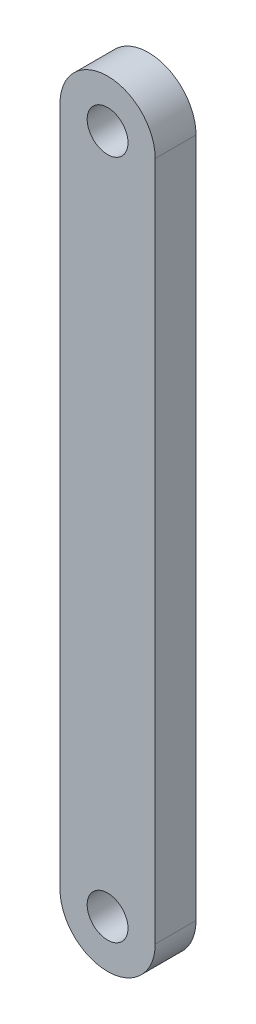
ISO-10303-21;
HEADER;
FILE_DESCRIPTION(('STEP AP214'),'2;1');
FILE_NAME('part.step','',(''),(''),'','','');
FILE_SCHEMA(('AUTOMOTIVE_DESIGN { 1 0 10303 214 1 1 1 1 }'));
ENDSEC;
DATA;
#1=APPLICATION_CONTEXT('core data for automotive mechanical design processes');
#2=APPLICATION_PROTOCOL_DEFINITION('international standard','automotive_design',2000,#1);
#3=PRODUCT_CONTEXT('',#1,'mechanical');
#4=PRODUCT('Part','Part','',(#3));
#5=PRODUCT_RELATED_PRODUCT_CATEGORY('part','',(#4));
#6=PRODUCT_DEFINITION_FORMATION('','',#4);
#7=PRODUCT_DEFINITION_CONTEXT('part definition',#1,'design');
#8=PRODUCT_DEFINITION('design','',#6,#7);
#9=PRODUCT_DEFINITION_SHAPE('','',#8);
#10=(LENGTH_UNIT() NAMED_UNIT(*) SI_UNIT(.MILLI.,.METRE.));
#11=(NAMED_UNIT(*) PLANE_ANGLE_UNIT() SI_UNIT($,.RADIAN.));
#12=(NAMED_UNIT(*) SI_UNIT($,.STERADIAN.) SOLID_ANGLE_UNIT());
#13=UNCERTAINTY_MEASURE_WITH_UNIT(LENGTH_MEASURE(1.E-05),#10,'distance_accuracy_value','');
#14=(GEOMETRIC_REPRESENTATION_CONTEXT(3) GLOBAL_UNCERTAINTY_ASSIGNED_CONTEXT((#13)) GLOBAL_UNIT_ASSIGNED_CONTEXT((#10,
#11,#12)) REPRESENTATION_CONTEXT('',''));
#15=CARTESIAN_POINT('',(0.,0.,0.));
#16=DIRECTION('',(0.,0.,1.));
#17=DIRECTION('',(1.,0.,0.));
#18=AXIS2_PLACEMENT_3D('',#15,#16,#17);
#19=CARTESIAN_POINT('',(0.,25.,1.5));
#20=DIRECTION('',(0.,0.,1.));
#21=DIRECTION('',(1.,0.,0.));
#22=AXIS2_PLACEMENT_3D('',#19,#20,#21);
#23=PLANE('',#22);
#24=CARTESIAN_POINT('',(0.,-25.,1.5));
#25=DIRECTION('',(0.,0.,1.));
#26=DIRECTION('',(1.,0.,0.));
#27=AXIS2_PLACEMENT_3D('',#24,#25,#26);
#28=CIRCLE('',#27,1.5);
#29=CARTESIAN_POINT('',(1.50000000000001,-25.,1.5));
#30=VERTEX_POINT('',#29);
#31=EDGE_CURVE('E103',#30,#30,#28,.T.);
#32=ORIENTED_EDGE('',*,*,#31,.F.);
#33=EDGE_LOOP('',(#32));
#34=FACE_BOUND('',#33,.T.);
#35=CARTESIAN_POINT('',(0.,25.,1.5));
#36=DIRECTION('',(0.,0.,1.));
#37=DIRECTION('',(1.,0.,0.));
#38=AXIS2_PLACEMENT_3D('',#35,#36,#37);
#39=CIRCLE('',#38,3.5);
#40=CARTESIAN_POINT('',(3.49999999999999,25.,1.5));
#41=VERTEX_POINT('',#40);
#42=CARTESIAN_POINT('',(-3.50000000000001,25.,1.5));
#43=VERTEX_POINT('',#42);
#44=EDGE_CURVE('E88',#41,#43,#39,.T.);
#45=ORIENTED_EDGE('',*,*,#44,.T.);
#46=DIRECTION('',(0.,-1.,0.));
#47=VECTOR('',#46,1.);
#48=CARTESIAN_POINT('',(-3.50000000000001,25.,1.5));
#49=LINE('',#48,#47);
#50=CARTESIAN_POINT('',(-3.49999999999999,-25.,1.5));
#51=VERTEX_POINT('',#50);
#52=EDGE_CURVE('E83',#43,#51,#49,.T.);
#53=ORIENTED_EDGE('',*,*,#52,.T.);
#54=CARTESIAN_POINT('',(0.,-25.,1.5));
#55=DIRECTION('',(0.,0.,1.));
#56=DIRECTION('',(1.,0.,0.));
#57=AXIS2_PLACEMENT_3D('',#54,#55,#56);
#58=CIRCLE('',#57,3.5);
#59=CARTESIAN_POINT('',(3.50000000000001,-25.,1.5));
#60=VERTEX_POINT('',#59);
#61=EDGE_CURVE('E86',#51,#60,#58,.T.);
#62=ORIENTED_EDGE('',*,*,#61,.T.);
#63=DIRECTION('',(0.,1.,0.));
#64=VECTOR('',#63,1.);
#65=CARTESIAN_POINT('',(3.49999999999999,25.,1.5));
#66=LINE('',#65,#64);
#67=EDGE_CURVE('E53',#60,#41,#66,.T.);
#68=ORIENTED_EDGE('',*,*,#67,.T.);
#69=EDGE_LOOP('',(#45,#53,#62,#68));
#70=FACE_BOUND('',#69,.T.);
#71=CARTESIAN_POINT('',(0.,25.,1.5));
#72=DIRECTION('',(0.,0.,1.));
#73=DIRECTION('',(1.,0.,0.));
#74=AXIS2_PLACEMENT_3D('',#71,#72,#73);
#75=CIRCLE('',#74,1.5);
#76=CARTESIAN_POINT('',(1.49999999999999,25.,1.5));
#77=VERTEX_POINT('',#76);
#78=EDGE_CURVE('E118',#77,#77,#75,.T.);
#79=ORIENTED_EDGE('',*,*,#78,.F.);
#80=EDGE_LOOP('',(#79));
#81=FACE_BOUND('',#80,.T.);
#82=ADVANCED_FACE('F36',(#34,#70,#81),#23,.T.);
#83=CARTESIAN_POINT('',(0.,25.,-1.5));
#84=DIRECTION('',(0.,0.,1.));
#85=DIRECTION('',(1.,0.,0.));
#86=AXIS2_PLACEMENT_3D('',#83,#84,#85);
#87=PLANE('',#86);
#88=CARTESIAN_POINT('',(0.,25.,-1.5));
#89=DIRECTION('',(0.,0.,1.));
#90=DIRECTION('',(1.,0.,0.));
#91=AXIS2_PLACEMENT_3D('',#88,#89,#90);
#92=CIRCLE('',#91,3.5);
#93=CARTESIAN_POINT('',(3.49999999999999,25.,-1.5));
#94=VERTEX_POINT('',#93);
#95=CARTESIAN_POINT('',(-3.50000000000001,25.,-1.5));
#96=VERTEX_POINT('',#95);
#97=EDGE_CURVE('E100',#94,#96,#92,.T.);
#98=ORIENTED_EDGE('',*,*,#97,.F.);
#99=DIRECTION('',(0.,1.,0.));
#100=VECTOR('',#99,1.);
#101=CARTESIAN_POINT('',(3.49999999999999,25.,-1.5));
#102=LINE('',#101,#100);
#103=CARTESIAN_POINT('',(3.50000000000001,-25.,-1.5));
#104=VERTEX_POINT('',#103);
#105=EDGE_CURVE('E76',#104,#94,#102,.T.);
#106=ORIENTED_EDGE('',*,*,#105,.F.);
#107=CARTESIAN_POINT('',(0.,-25.,-1.5));
#108=DIRECTION('',(0.,0.,1.));
#109=DIRECTION('',(1.,0.,0.));
#110=AXIS2_PLACEMENT_3D('',#107,#108,#109);
#111=CIRCLE('',#110,3.5);
#112=CARTESIAN_POINT('',(-3.49999999999999,-25.,-1.5));
#113=VERTEX_POINT('',#112);
#114=EDGE_CURVE('E70',#113,#104,#111,.T.);
#115=ORIENTED_EDGE('',*,*,#114,.F.);
#116=DIRECTION('',(0.,-1.,0.));
#117=VECTOR('',#116,1.);
#118=CARTESIAN_POINT('',(-3.50000000000001,25.,-1.5));
#119=LINE('',#118,#117);
#120=EDGE_CURVE('E92',#96,#113,#119,.T.);
#121=ORIENTED_EDGE('',*,*,#120,.F.);
#122=EDGE_LOOP('',(#98,#106,#115,#121));
#123=FACE_BOUND('',#122,.T.);
#124=CARTESIAN_POINT('',(0.,-25.,-1.5));
#125=DIRECTION('',(0.,0.,1.));
#126=DIRECTION('',(1.,0.,0.));
#127=AXIS2_PLACEMENT_3D('',#124,#125,#126);
#128=CIRCLE('',#127,1.5);
#129=CARTESIAN_POINT('',(1.50000000000001,-25.,-1.5));
#130=VERTEX_POINT('',#129);
#131=EDGE_CURVE('E115',#130,#130,#128,.T.);
#132=ORIENTED_EDGE('',*,*,#131,.T.);
#133=EDGE_LOOP('',(#132));
#134=FACE_BOUND('',#133,.T.);
#135=CARTESIAN_POINT('',(0.,25.,-1.5));
#136=DIRECTION('',(0.,0.,1.));
#137=DIRECTION('',(1.,0.,0.));
#138=AXIS2_PLACEMENT_3D('',#135,#136,#137);
#139=CIRCLE('',#138,1.5);
#140=CARTESIAN_POINT('',(1.49999999999999,25.,-1.5));
#141=VERTEX_POINT('',#140);
#142=EDGE_CURVE('E121',#141,#141,#139,.T.);
#143=ORIENTED_EDGE('',*,*,#142,.T.);
#144=EDGE_LOOP('',(#143));
#145=FACE_BOUND('',#144,.T.);
#146=ADVANCED_FACE('F111',(#123,#134,#145),#87,.F.);
#147=CARTESIAN_POINT('',(0.,25.,1.5));
#148=DIRECTION('',(0.,0.,-1.));
#149=DIRECTION('',(-1.,0.,0.));
#150=AXIS2_PLACEMENT_3D('',#147,#148,#149);
#151=CYLINDRICAL_SURFACE('',#150,3.5);
#152=ORIENTED_EDGE('',*,*,#97,.T.);
#153=DIRECTION('',(0.,0.,-1.));
#154=VECTOR('',#153,1.);
#155=CARTESIAN_POINT('',(-3.50000000000001,25.,1.5));
#156=LINE('',#155,#154);
#157=EDGE_CURVE('E11',#43,#96,#156,.T.);
#158=ORIENTED_EDGE('',*,*,#157,.F.);
#159=ORIENTED_EDGE('',*,*,#44,.F.);
#160=DIRECTION('',(0.,0.,-1.));
#161=VECTOR('',#160,1.);
#162=CARTESIAN_POINT('',(3.49999999999999,25.,1.5));
#163=LINE('',#162,#161);
#164=EDGE_CURVE('E96',#41,#94,#163,.T.);
#165=ORIENTED_EDGE('',*,*,#164,.T.);
#166=EDGE_LOOP('',(#152,#158,#159,#165));
#167=FACE_BOUND('',#166,.T.);
#168=ADVANCED_FACE('F38',(#167),#151,.T.);
#169=CARTESIAN_POINT('',(-3.50000000000001,25.,1.5));
#170=DIRECTION('',(1.,0.,0.));
#171=DIRECTION('',(0.,1.,0.));
#172=AXIS2_PLACEMENT_3D('',#169,#170,#171);
#173=PLANE('',#172);
#174=ORIENTED_EDGE('',*,*,#120,.T.);
#175=DIRECTION('',(0.,0.,-1.));
#176=VECTOR('',#175,1.);
#177=CARTESIAN_POINT('',(-3.49999999999999,-25.,1.5));
#178=LINE('',#177,#176);
#179=EDGE_CURVE('E45',#51,#113,#178,.T.);
#180=ORIENTED_EDGE('',*,*,#179,.F.);
#181=ORIENTED_EDGE('',*,*,#52,.F.);
#182=ORIENTED_EDGE('',*,*,#157,.T.);
#183=EDGE_LOOP('',(#174,#180,#181,#182));
#184=FACE_BOUND('',#183,.T.);
#185=ADVANCED_FACE('F91',(#184),#173,.F.);
#186=CARTESIAN_POINT('',(0.,-25.,1.5));
#187=DIRECTION('',(0.,0.,-1.));
#188=DIRECTION('',(-1.,0.,0.));
#189=AXIS2_PLACEMENT_3D('',#186,#187,#188);
#190=CYLINDRICAL_SURFACE('',#189,3.5);
#191=ORIENTED_EDGE('',*,*,#114,.T.);
#192=DIRECTION('',(0.,0.,-1.));
#193=VECTOR('',#192,1.);
#194=CARTESIAN_POINT('',(3.50000000000001,-25.,1.5));
#195=LINE('',#194,#193);
#196=EDGE_CURVE('E93',#60,#104,#195,.T.);
#197=ORIENTED_EDGE('',*,*,#196,.F.);
#198=ORIENTED_EDGE('',*,*,#61,.F.);
#199=ORIENTED_EDGE('',*,*,#179,.T.);
#200=EDGE_LOOP('',(#191,#197,#198,#199));
#201=FACE_BOUND('',#200,.T.);
#202=ADVANCED_FACE('F94',(#201),#190,.T.);
#203=CARTESIAN_POINT('',(3.49999999999999,25.,1.5));
#204=DIRECTION('',(-1.,0.,0.));
#205=DIRECTION('',(0.,-1.,0.));
#206=AXIS2_PLACEMENT_3D('',#203,#204,#205);
#207=PLANE('',#206);
#208=ORIENTED_EDGE('',*,*,#105,.T.);
#209=ORIENTED_EDGE('',*,*,#164,.F.);
#210=ORIENTED_EDGE('',*,*,#67,.F.);
#211=ORIENTED_EDGE('',*,*,#196,.T.);
#212=EDGE_LOOP('',(#208,#209,#210,#211));
#213=FACE_BOUND('',#212,.T.);
#214=ADVANCED_FACE('F108',(#213),#207,.F.);
#215=CARTESIAN_POINT('',(0.,-25.,1.5));
#216=DIRECTION('',(0.,0.,-1.));
#217=DIRECTION('',(-1.,0.,0.));
#218=AXIS2_PLACEMENT_3D('',#215,#216,#217);
#219=CYLINDRICAL_SURFACE('',#218,1.5);
#220=ORIENTED_EDGE('',*,*,#31,.T.);
#221=EDGE_LOOP('',(#220));
#222=FACE_BOUND('',#221,.T.);
#223=ORIENTED_EDGE('',*,*,#131,.F.);
#224=EDGE_LOOP('',(#223));
#225=FACE_BOUND('',#224,.T.);
#226=ADVANCED_FACE('F138',(#222,#225),#219,.F.);
#227=CARTESIAN_POINT('',(0.,25.,1.5));
#228=DIRECTION('',(0.,0.,-1.));
#229=DIRECTION('',(-1.,0.,0.));
#230=AXIS2_PLACEMENT_3D('',#227,#228,#229);
#231=CYLINDRICAL_SURFACE('',#230,1.5);
#232=ORIENTED_EDGE('',*,*,#78,.T.);
#233=EDGE_LOOP('',(#232));
#234=FACE_BOUND('',#233,.T.);
#235=ORIENTED_EDGE('',*,*,#142,.F.);
#236=EDGE_LOOP('',(#235));
#237=FACE_BOUND('',#236,.T.);
#238=ADVANCED_FACE('F127',(#234,#237),#231,.F.);
#239=CLOSED_SHELL('',(#82,#146,#168,#185,#202,#214,#226,#238));
#240=MANIFOLD_SOLID_BREP('B2',#239);
#241=ADVANCED_BREP_SHAPE_REPRESENTATION('',(#18,#240),#14);
#242=SHAPE_DEFINITION_REPRESENTATION(#9,#241);
ENDSEC;
END-ISO-10303-21;
